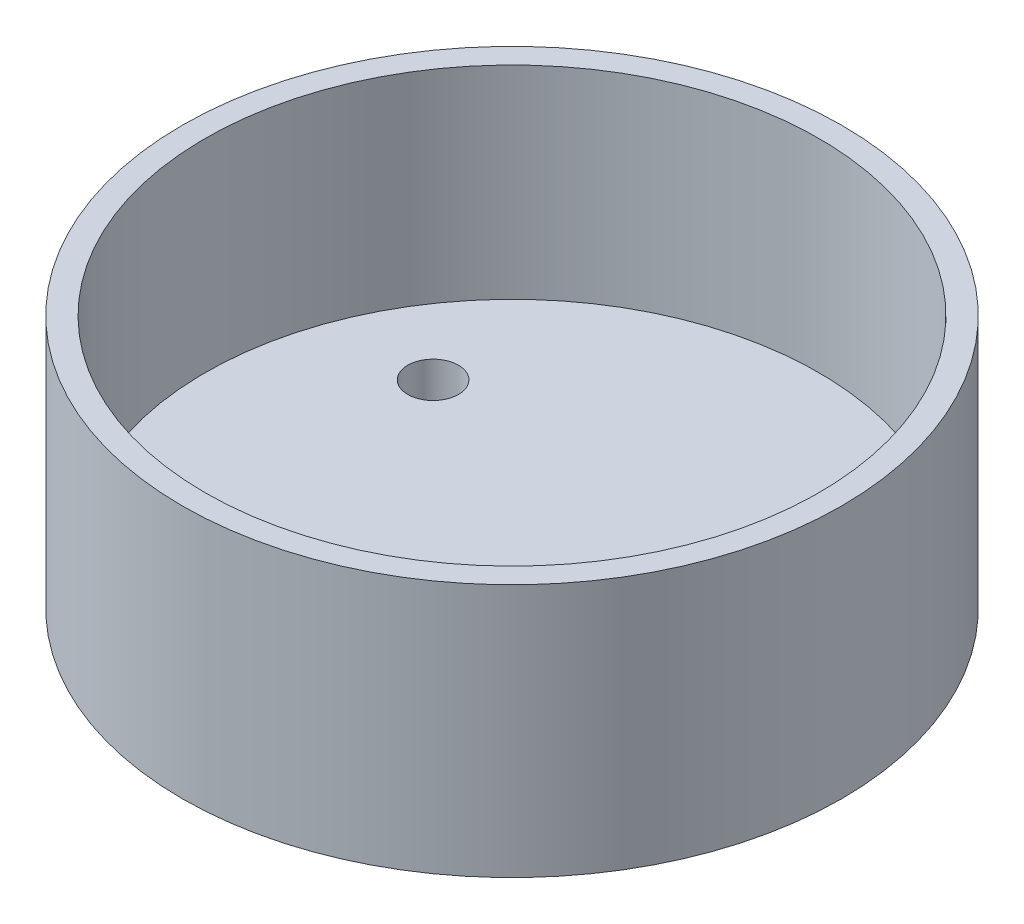
ISO-10303-21;
HEADER;
FILE_DESCRIPTION(('STEP AP214'),'2;1');
FILE_NAME('part.step','',(''),(''),'','','');
FILE_SCHEMA(('AUTOMOTIVE_DESIGN { 1 0 10303 214 1 1 1 1 }'));
ENDSEC;
DATA;
#1=APPLICATION_CONTEXT('core data for automotive mechanical design processes');
#2=APPLICATION_PROTOCOL_DEFINITION('international standard','automotive_design',2000,#1);
#3=PRODUCT_CONTEXT('',#1,'mechanical');
#4=PRODUCT('Part','Part','',(#3));
#5=PRODUCT_RELATED_PRODUCT_CATEGORY('part','',(#4));
#6=PRODUCT_DEFINITION_FORMATION('','',#4);
#7=PRODUCT_DEFINITION_CONTEXT('part definition',#1,'design');
#8=PRODUCT_DEFINITION('design','',#6,#7);
#9=PRODUCT_DEFINITION_SHAPE('','',#8);
#10=(LENGTH_UNIT() NAMED_UNIT(*) SI_UNIT(.MILLI.,.METRE.));
#11=(NAMED_UNIT(*) PLANE_ANGLE_UNIT() SI_UNIT($,.RADIAN.));
#12=(NAMED_UNIT(*) SI_UNIT($,.STERADIAN.) SOLID_ANGLE_UNIT());
#13=UNCERTAINTY_MEASURE_WITH_UNIT(LENGTH_MEASURE(1.E-05),#10,'distance_accuracy_value','');
#14=(GEOMETRIC_REPRESENTATION_CONTEXT(3) GLOBAL_UNCERTAINTY_ASSIGNED_CONTEXT((#13)) GLOBAL_UNIT_ASSIGNED_CONTEXT((#10,
#11,#12)) REPRESENTATION_CONTEXT('',''));
#15=CARTESIAN_POINT('',(0.,0.,0.));
#16=DIRECTION('',(0.,0.,1.));
#17=DIRECTION('',(1.,0.,0.));
#18=AXIS2_PLACEMENT_3D('',#15,#16,#17);
#19=CARTESIAN_POINT('',(0.,10.,0.));
#20=DIRECTION('',(0.,-1.,0.));
#21=DIRECTION('',(0.,0.,-1.));
#22=AXIS2_PLACEMENT_3D('',#19,#20,#21);
#23=CYLINDRICAL_SURFACE('',#22,13.);
#24=CARTESIAN_POINT('',(0.,10.,0.));
#25=DIRECTION('',(0.,1.,0.));
#26=DIRECTION('',(0.,0.,1.));
#27=AXIS2_PLACEMENT_3D('',#24,#25,#26);
#28=CIRCLE('',#27,13.);
#29=CARTESIAN_POINT('',(0.,10.,13.));
#30=VERTEX_POINT('',#29);
#31=EDGE_CURVE('E10',#30,#30,#28,.T.);
#32=ORIENTED_EDGE('',*,*,#31,.F.);
#33=EDGE_LOOP('',(#32));
#34=FACE_BOUND('',#33,.T.);
#35=CARTESIAN_POINT('',(0.,0.,0.));
#36=DIRECTION('',(0.,1.,0.));
#37=DIRECTION('',(0.,0.,1.));
#38=AXIS2_PLACEMENT_3D('',#35,#36,#37);
#39=CIRCLE('',#38,13.);
#40=CARTESIAN_POINT('',(0.,0.,13.));
#41=VERTEX_POINT('',#40);
#42=EDGE_CURVE('E40',#41,#41,#39,.T.);
#43=ORIENTED_EDGE('',*,*,#42,.T.);
#44=EDGE_LOOP('',(#43));
#45=FACE_BOUND('',#44,.T.);
#46=ADVANCED_FACE('F37',(#34,#45),#23,.T.);
#47=CARTESIAN_POINT('',(0.,10.,0.));
#48=DIRECTION('',(0.,1.,0.));
#49=DIRECTION('',(0.,0.,1.));
#50=AXIS2_PLACEMENT_3D('',#47,#48,#49);
#51=PLANE('',#50);
#52=CARTESIAN_POINT('',(0.,10.,0.));
#53=DIRECTION('',(0.,1.,0.));
#54=DIRECTION('',(0.,0.,1.));
#55=AXIS2_PLACEMENT_3D('',#52,#53,#54);
#56=CIRCLE('',#55,12.1);
#57=CARTESIAN_POINT('',(0.,10.,12.1));
#58=VERTEX_POINT('',#57);
#59=EDGE_CURVE('E49',#58,#58,#56,.T.);
#60=ORIENTED_EDGE('',*,*,#59,.F.);
#61=EDGE_LOOP('',(#60));
#62=FACE_BOUND('',#61,.T.);
#63=ORIENTED_EDGE('',*,*,#31,.T.);
#64=EDGE_LOOP('',(#63));
#65=FACE_BOUND('',#64,.T.);
#66=ADVANCED_FACE('F94',(#62,#65),#51,.T.);
#67=CARTESIAN_POINT('',(0.,0.,0.));
#68=DIRECTION('',(0.,1.,0.));
#69=DIRECTION('',(0.,0.,1.));
#70=AXIS2_PLACEMENT_3D('',#67,#68,#69);
#71=PLANE('',#70);
#72=CARTESIAN_POINT('',(-7.36121593216773,0.,-4.25));
#73=DIRECTION('',(0.,1.,0.));
#74=DIRECTION('',(0.,0.,1.));
#75=AXIS2_PLACEMENT_3D('',#72,#73,#74);
#76=CIRCLE('',#75,1.);
#77=CARTESIAN_POINT('',(-7.36121593216773,0.,-3.25));
#78=VERTEX_POINT('',#77);
#79=EDGE_CURVE('E52',#78,#78,#76,.T.);
#80=ORIENTED_EDGE('',*,*,#79,.T.);
#81=EDGE_LOOP('',(#80));
#82=FACE_BOUND('',#81,.T.);
#83=CARTESIAN_POINT('',(7.36121593216773,0.,-4.25));
#84=DIRECTION('',(0.,1.,0.));
#85=DIRECTION('',(0.,0.,1.));
#86=AXIS2_PLACEMENT_3D('',#83,#84,#85);
#87=CIRCLE('',#86,1.);
#88=CARTESIAN_POINT('',(7.36121593216773,0.,-3.25));
#89=VERTEX_POINT('',#88);
#90=EDGE_CURVE('E57',#89,#89,#87,.T.);
#91=ORIENTED_EDGE('',*,*,#90,.T.);
#92=EDGE_LOOP('',(#91));
#93=FACE_BOUND('',#92,.T.);
#94=CARTESIAN_POINT('',(0.,0.,8.5));
#95=DIRECTION('',(0.,1.,0.));
#96=DIRECTION('',(0.,0.,1.));
#97=AXIS2_PLACEMENT_3D('',#94,#95,#96);
#98=CIRCLE('',#97,1.);
#99=CARTESIAN_POINT('',(0.,0.,9.5));
#100=VERTEX_POINT('',#99);
#101=EDGE_CURVE('E60',#100,#100,#98,.T.);
#102=ORIENTED_EDGE('',*,*,#101,.T.);
#103=EDGE_LOOP('',(#102));
#104=FACE_BOUND('',#103,.T.);
#105=ORIENTED_EDGE('',*,*,#42,.F.);
#106=EDGE_LOOP('',(#105));
#107=FACE_BOUND('',#106,.T.);
#108=ADVANCED_FACE('F90',(#82,#93,#104,#107),#71,.F.);
#109=CARTESIAN_POINT('',(0.,2.,0.));
#110=DIRECTION('',(0.,1.,0.));
#111=DIRECTION('',(0.,0.,1.));
#112=AXIS2_PLACEMENT_3D('',#109,#110,#111);
#113=CYLINDRICAL_SURFACE('',#112,12.1);
#114=CARTESIAN_POINT('',(0.,2.,0.));
#115=DIRECTION('',(0.,1.,0.));
#116=DIRECTION('',(0.,0.,1.));
#117=AXIS2_PLACEMENT_3D('',#114,#115,#116);
#118=CIRCLE('',#117,12.1);
#119=CARTESIAN_POINT('',(0.,2.,12.1));
#120=VERTEX_POINT('',#119);
#121=EDGE_CURVE('E47',#120,#120,#118,.T.);
#122=ORIENTED_EDGE('',*,*,#121,.F.);
#123=EDGE_LOOP('',(#122));
#124=FACE_BOUND('',#123,.T.);
#125=ORIENTED_EDGE('',*,*,#59,.T.);
#126=EDGE_LOOP('',(#125));
#127=FACE_BOUND('',#126,.T.);
#128=ADVANCED_FACE('F80',(#124,#127),#113,.F.);
#129=CARTESIAN_POINT('',(0.,2.,0.));
#130=DIRECTION('',(0.,1.,0.));
#131=DIRECTION('',(0.,0.,1.));
#132=AXIS2_PLACEMENT_3D('',#129,#130,#131);
#133=PLANE('',#132);
#134=CARTESIAN_POINT('',(-7.36121593216773,2.,-4.25));
#135=DIRECTION('',(0.,1.,0.));
#136=DIRECTION('',(0.,0.,1.));
#137=AXIS2_PLACEMENT_3D('',#134,#135,#136);
#138=CIRCLE('',#137,1.);
#139=CARTESIAN_POINT('',(-7.36121593216773,2.,-3.25));
#140=VERTEX_POINT('',#139);
#141=EDGE_CURVE('E63',#140,#140,#138,.T.);
#142=ORIENTED_EDGE('',*,*,#141,.F.);
#143=EDGE_LOOP('',(#142));
#144=FACE_BOUND('',#143,.T.);
#145=CARTESIAN_POINT('',(7.36121593216773,2.,-4.25));
#146=DIRECTION('',(0.,1.,0.));
#147=DIRECTION('',(0.,0.,1.));
#148=AXIS2_PLACEMENT_3D('',#145,#146,#147);
#149=CIRCLE('',#148,1.);
#150=CARTESIAN_POINT('',(7.36121593216773,2.,-3.25));
#151=VERTEX_POINT('',#150);
#152=EDGE_CURVE('E67',#151,#151,#149,.T.);
#153=ORIENTED_EDGE('',*,*,#152,.F.);
#154=EDGE_LOOP('',(#153));
#155=FACE_BOUND('',#154,.T.);
#156=CARTESIAN_POINT('',(0.,2.,8.5));
#157=DIRECTION('',(0.,1.,0.));
#158=DIRECTION('',(0.,0.,1.));
#159=AXIS2_PLACEMENT_3D('',#156,#157,#158);
#160=CIRCLE('',#159,1.);
#161=CARTESIAN_POINT('',(0.,2.,9.5));
#162=VERTEX_POINT('',#161);
#163=EDGE_CURVE('E64',#162,#162,#160,.T.);
#164=ORIENTED_EDGE('',*,*,#163,.F.);
#165=EDGE_LOOP('',(#164));
#166=FACE_BOUND('',#165,.T.);
#167=ORIENTED_EDGE('',*,*,#121,.T.);
#168=EDGE_LOOP('',(#167));
#169=FACE_BOUND('',#168,.T.);
#170=ADVANCED_FACE('F76',(#144,#155,#166,#169),#133,.T.);
#171=CARTESIAN_POINT('',(0.,-6.,8.5));
#172=DIRECTION('',(0.,1.,0.));
#173=DIRECTION('',(0.,0.,1.));
#174=AXIS2_PLACEMENT_3D('',#171,#172,#173);
#175=CYLINDRICAL_SURFACE('',#174,1.);
#176=ORIENTED_EDGE('',*,*,#163,.T.);
#177=EDGE_LOOP('',(#176));
#178=FACE_BOUND('',#177,.T.);
#179=ORIENTED_EDGE('',*,*,#101,.F.);
#180=EDGE_LOOP('',(#179));
#181=FACE_BOUND('',#180,.T.);
#182=ADVANCED_FACE('F79',(#178,#181),#175,.F.);
#183=CARTESIAN_POINT('',(7.36121593216773,-6.,-4.25));
#184=DIRECTION('',(0.,1.,0.));
#185=DIRECTION('',(0.,0.,1.));
#186=AXIS2_PLACEMENT_3D('',#183,#184,#185);
#187=CYLINDRICAL_SURFACE('',#186,1.);
#188=ORIENTED_EDGE('',*,*,#152,.T.);
#189=EDGE_LOOP('',(#188));
#190=FACE_BOUND('',#189,.T.);
#191=ORIENTED_EDGE('',*,*,#90,.F.);
#192=EDGE_LOOP('',(#191));
#193=FACE_BOUND('',#192,.T.);
#194=ADVANCED_FACE('F106',(#190,#193),#187,.F.);
#195=CARTESIAN_POINT('',(-7.36121593216773,-6.,-4.25));
#196=DIRECTION('',(0.,1.,0.));
#197=DIRECTION('',(0.,0.,1.));
#198=AXIS2_PLACEMENT_3D('',#195,#196,#197);
#199=CYLINDRICAL_SURFACE('',#198,1.);
#200=ORIENTED_EDGE('',*,*,#141,.T.);
#201=EDGE_LOOP('',(#200));
#202=FACE_BOUND('',#201,.T.);
#203=ORIENTED_EDGE('',*,*,#79,.F.);
#204=EDGE_LOOP('',(#203));
#205=FACE_BOUND('',#204,.T.);
#206=ADVANCED_FACE('F73',(#202,#205),#199,.F.);
#207=CLOSED_SHELL('',(#46,#66,#108,#128,#170,#182,#194,#206));
#208=MANIFOLD_SOLID_BREP('B2',#207);
#209=ADVANCED_BREP_SHAPE_REPRESENTATION('',(#18,#208),#14);
#210=SHAPE_DEFINITION_REPRESENTATION(#9,#209);
ENDSEC;
END-ISO-10303-21;
